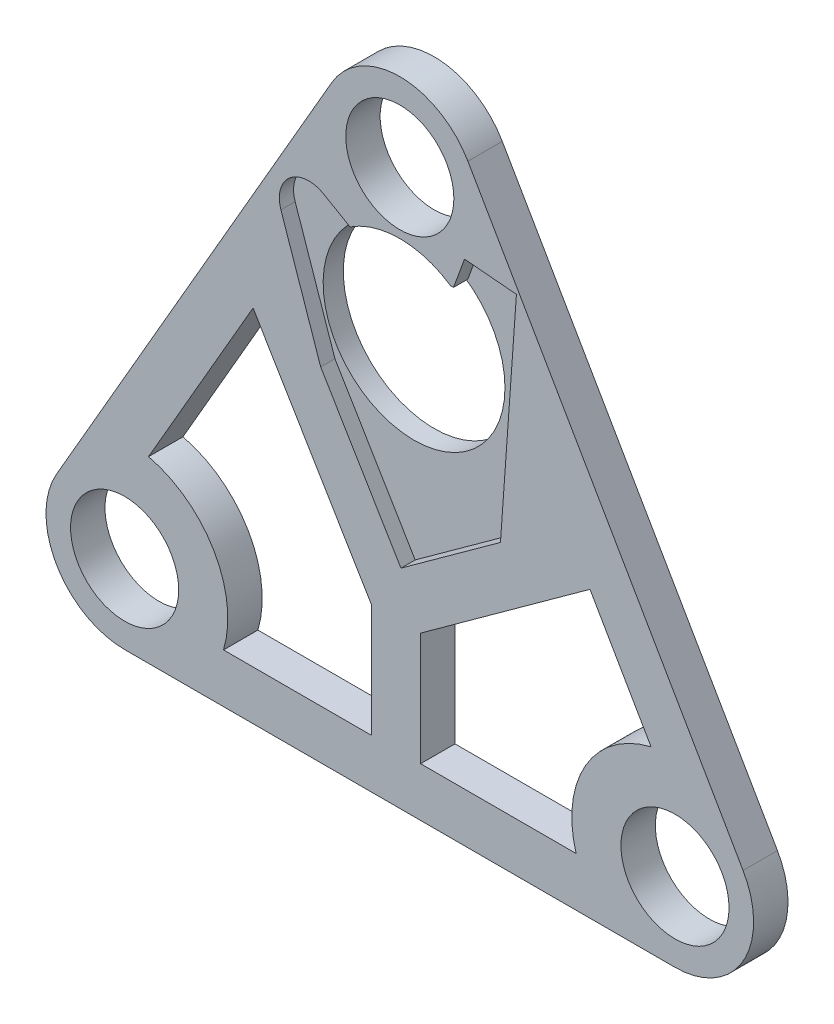
ISO-10303-21;
HEADER;
FILE_DESCRIPTION(('STEP AP214'),'2;1');
FILE_NAME('part.step','',(''),(''),'','','');
FILE_SCHEMA(('AUTOMOTIVE_DESIGN { 1 0 10303 214 1 1 1 1 }'));
ENDSEC;
DATA;
#1=APPLICATION_CONTEXT('core data for automotive mechanical design processes');
#2=APPLICATION_PROTOCOL_DEFINITION('international standard','automotive_design',2000,#1);
#3=PRODUCT_CONTEXT('',#1,'mechanical');
#4=PRODUCT('Part','Part','',(#3));
#5=PRODUCT_RELATED_PRODUCT_CATEGORY('part','',(#4));
#6=PRODUCT_DEFINITION_FORMATION('','',#4);
#7=PRODUCT_DEFINITION_CONTEXT('part definition',#1,'design');
#8=PRODUCT_DEFINITION('design','',#6,#7);
#9=PRODUCT_DEFINITION_SHAPE('','',#8);
#10=(LENGTH_UNIT() NAMED_UNIT(*) SI_UNIT(.MILLI.,.METRE.));
#11=(NAMED_UNIT(*) PLANE_ANGLE_UNIT() SI_UNIT($,.RADIAN.));
#12=(NAMED_UNIT(*) SI_UNIT($,.STERADIAN.) SOLID_ANGLE_UNIT());
#13=UNCERTAINTY_MEASURE_WITH_UNIT(LENGTH_MEASURE(1.E-05),#10,'distance_accuracy_value','');
#14=(GEOMETRIC_REPRESENTATION_CONTEXT(3) GLOBAL_UNCERTAINTY_ASSIGNED_CONTEXT((#13)) GLOBAL_UNIT_ASSIGNED_CONTEXT((#10,
#11,#12)) REPRESENTATION_CONTEXT('',''));
#15=CARTESIAN_POINT('',(0.,0.,0.));
#16=DIRECTION('',(0.,0.,1.));
#17=DIRECTION('',(1.,0.,0.));
#18=AXIS2_PLACEMENT_3D('',#15,#16,#17);
#19=CARTESIAN_POINT('',(56.,96.9948452238571,7.));
#20=DIRECTION('',(0.,0.,1.));
#21=DIRECTION('',(1.,0.,0.));
#22=AXIS2_PLACEMENT_3D('',#19,#20,#21);
#23=PLANE('',#22);
#24=DIRECTION('',(-0.51350839061396,0.858084572037664,0.));
#25=VECTOR('',#24,1.);
#26=CARTESIAN_POINT('',(26.1396160586901,57.2751431039945,7.));
#27=LINE('',#26,#25);
#28=CARTESIAN_POINT('',(50.2315466242087,17.0169617251912,7.));
#29=VERTEX_POINT('',#28);
#30=CARTESIAN_POINT('',(26.1396160586901,57.2751431039945,7.));
#31=VERTEX_POINT('',#30);
#32=EDGE_CURVE('E57',#29,#31,#27,.T.);
#33=ORIENTED_EDGE('',*,*,#32,.F.);
#34=DIRECTION('',(0.,1.,0.));
#35=VECTOR('',#34,1.);
#36=CARTESIAN_POINT('',(50.2315466242087,17.0169617251912,7.));
#37=LINE('',#36,#35);
#38=CARTESIAN_POINT('',(50.2315466242087,-6.,7.));
#39=VERTEX_POINT('',#38);
#40=EDGE_CURVE('E240',#39,#29,#37,.T.);
#41=ORIENTED_EDGE('',*,*,#40,.F.);
#42=DIRECTION('',(1.,0.,0.));
#43=VECTOR('',#42,1.);
#44=CARTESIAN_POINT('',(20.1246117974981,-6.,7.));
#45=LINE('',#44,#43);
#46=CARTESIAN_POINT('',(20.1246117974981,-6.00000000000001,7.));
#47=VERTEX_POINT('',#46);
#48=EDGE_CURVE('E244',#47,#39,#45,.T.);
#49=ORIENTED_EDGE('',*,*,#48,.F.);
#50=CARTESIAN_POINT('',(0.,0.,7.));
#51=DIRECTION('',(0.,0.,-1.));
#52=DIRECTION('',(1.,0.,0.));
#53=AXIS2_PLACEMENT_3D('',#50,#51,#52);
#54=CIRCLE('',#53,21.);
#55=CARTESIAN_POINT('',(4.86615347604242,20.4284250579334,7.));
#56=VERTEX_POINT('',#55);
#57=EDGE_CURVE('E260',#56,#47,#54,.T.);
#58=ORIENTED_EDGE('',*,*,#57,.F.);
#59=DIRECTION('',(-0.5,-0.866025403784439,0.));
#60=VECTOR('',#59,1.);
#61=CARTESIAN_POINT('',(26.1396160586901,57.2751431039945,7.));
#62=LINE('',#61,#60);
#63=EDGE_CURVE('E256',#31,#56,#62,.T.);
#64=ORIENTED_EDGE('',*,*,#63,.F.);
#65=EDGE_LOOP('',(#33,#41,#49,#58,#64));
#66=FACE_BOUND('',#65,.T.);
#67=CARTESIAN_POINT('',(112.,0.,7.));
#68=DIRECTION('',(0.,0.,-1.));
#69=DIRECTION('',(1.,0.,0.));
#70=AXIS2_PLACEMENT_3D('',#67,#68,#69);
#71=CIRCLE('',#70,21.);
#72=CARTESIAN_POINT('',(91.8753882025019,-6.,7.));
#73=VERTEX_POINT('',#72);
#74=CARTESIAN_POINT('',(107.133846523958,20.4284250579333,7.));
#75=VERTEX_POINT('',#74);
#76=EDGE_CURVE('E65',#73,#75,#71,.T.);
#77=ORIENTED_EDGE('',*,*,#76,.F.);
#78=DIRECTION('',(1.,0.,0.));
#79=VECTOR('',#78,1.);
#80=CARTESIAN_POINT('',(60.2315466242087,-6.,7.));
#81=LINE('',#80,#79);
#82=CARTESIAN_POINT('',(60.2315466242087,-6.,7.));
#83=VERTEX_POINT('',#82);
#84=EDGE_CURVE('E284',#83,#73,#81,.T.);
#85=ORIENTED_EDGE('',*,*,#84,.F.);
#86=DIRECTION('',(0.,-1.,0.));
#87=VECTOR('',#86,1.);
#88=CARTESIAN_POINT('',(60.2315466242087,17.0169617251913,7.));
#89=LINE('',#88,#87);
#90=CARTESIAN_POINT('',(60.2315466242087,17.0169617251913,7.));
#91=VERTEX_POINT('',#90);
#92=EDGE_CURVE('E311',#91,#83,#89,.T.);
#93=ORIENTED_EDGE('',*,*,#92,.F.);
#94=DIRECTION('',(-0.810064095987129,-0.586341334371504,0.));
#95=VECTOR('',#94,1.);
#96=CARTESIAN_POINT('',(94.6994013606131,41.965515844775,7.));
#97=LINE('',#96,#95);
#98=CARTESIAN_POINT('',(94.6994013606131,41.965515844775,7.));
#99=VERTEX_POINT('',#98);
#100=EDGE_CURVE('E307',#99,#91,#97,.T.);
#101=ORIENTED_EDGE('',*,*,#100,.F.);
#102=DIRECTION('',(-0.5,0.866025403784439,0.));
#103=VECTOR('',#102,1.);
#104=CARTESIAN_POINT('',(94.6994013606131,41.965515844775,7.));
#105=LINE('',#104,#103);
#106=EDGE_CURVE('E303',#75,#99,#105,.T.);
#107=ORIENTED_EDGE('',*,*,#106,.F.);
#108=EDGE_LOOP('',(#77,#85,#93,#101,#107));
#109=FACE_BOUND('',#108,.T.);
#110=DIRECTION('',(-0.866025403784443,0.499999999999992,0.));
#111=VECTOR('',#110,1.);
#112=CARTESIAN_POINT('',(46.11,81.2948452238571,7.));
#113=LINE('',#112,#111);
#114=CARTESIAN_POINT('',(45.8768837947941,81.4294349276852,7.));
#115=VERTEX_POINT('',#114);
#116=CARTESIAN_POINT('',(40.4808348754011,84.5448452238571,7.));
#117=VERTEX_POINT('',#116);
#118=EDGE_CURVE('E270',#115,#117,#113,.T.);
#119=ORIENTED_EDGE('',*,*,#118,.F.);
#120=CARTESIAN_POINT('',(56.,65.9448452238571,7.));
#121=DIRECTION('',(0.,0.,1.));
#122=DIRECTION('',(1.,0.,0.));
#123=AXIS2_PLACEMENT_3D('',#120,#121,#122);
#124=CIRCLE('',#123,18.5);
#125=CARTESIAN_POINT('',(66.3260592676974,81.2948452238571,7.));
#126=VERTEX_POINT('',#125);
#127=EDGE_CURVE('E402',#126,#115,#124,.T.);
#128=ORIENTED_EDGE('',*,*,#127,.F.);
#129=DIRECTION('',(-1.,0.,0.));
#130=VECTOR('',#129,1.);
#131=CARTESIAN_POINT('',(46.11,81.2948452238571,7.));
#132=LINE('',#131,#130);
#133=CARTESIAN_POINT('',(66.94,81.2948452238571,7.));
#134=VERTEX_POINT('',#133);
#135=EDGE_CURVE('E335',#134,#126,#132,.T.);
#136=ORIENTED_EDGE('',*,*,#135,.F.);
#137=DIRECTION('',(-0.342020143325666,-0.939692620785909,0.));
#138=VECTOR('',#137,1.);
#139=CARTESIAN_POINT('',(66.94,81.2948452238571,7.));
#140=LINE('',#139,#138);
#141=CARTESIAN_POINT('',(69.1631309316168,87.4028472589656,7.));
#142=VERTEX_POINT('',#141);
#143=EDGE_CURVE('E393',#142,#134,#140,.T.);
#144=ORIENTED_EDGE('',*,*,#143,.F.);
#145=DIRECTION('',(-0.996194698091746,0.087155742747658,0.));
#146=VECTOR('',#145,1.);
#147=CARTESIAN_POINT('',(69.1631309316168,87.4028472589656,7.));
#148=LINE('',#147,#146);
#149=CARTESIAN_POINT('',(79.7351728545121,86.4779134403914,7.));
#150=VERTEX_POINT('',#149);
#151=EDGE_CURVE('E389',#150,#142,#148,.T.);
#152=ORIENTED_EDGE('',*,*,#151,.F.);
#153=DIRECTION('',(0.0715356429861935,0.997438044082213,0.));
#154=VECTOR('',#153,1.);
#155=CARTESIAN_POINT('',(79.7351728545121,86.4779134403914,7.));
#156=LINE('',#155,#154);
#157=CARTESIAN_POINT('',(76.4824471679298,41.1244055759732,7.));
#158=VERTEX_POINT('',#157);
#159=EDGE_CURVE('E385',#158,#150,#156,.T.);
#160=ORIENTED_EDGE('',*,*,#159,.F.);
#161=DIRECTION('',(0.810064095987129,0.586341334371504,0.));
#162=VECTOR('',#161,1.);
#163=CARTESIAN_POINT('',(76.4824471679298,41.1244055759732,7.));
#164=LINE('',#163,#162);
#165=CARTESIAN_POINT('',(56.2308447682516,26.4658722166855,7.));
#166=VERTEX_POINT('',#165);
#167=EDGE_CURVE('E381',#166,#158,#164,.T.);
#168=ORIENTED_EDGE('',*,*,#167,.F.);
#169=DIRECTION('',(0.51350839061396,-0.858084572037664,0.));
#170=VECTOR('',#169,1.);
#171=CARTESIAN_POINT('',(56.2308447682516,26.4658722166855,7.));
#172=LINE('',#171,#170);
#173=CARTESIAN_POINT('',(39.9012779467277,53.7529616074832,7.));
#174=VERTEX_POINT('',#173);
#175=EDGE_CURVE('E377',#174,#166,#172,.T.);
#176=ORIENTED_EDGE('',*,*,#175,.F.);
#177=DIRECTION('',(0.323881185998739,-0.94609776310699,0.));
#178=VECTOR('',#177,1.);
#179=CARTESIAN_POINT('',(39.9012779467277,53.7529616074832,7.));
#180=LINE('',#179,#178);
#181=CARTESIAN_POINT('',(31.8042482967592,77.405405685158,7.));
#182=VERTEX_POINT('',#181);
#183=EDGE_CURVE('E373',#182,#174,#180,.T.);
#184=ORIENTED_EDGE('',*,*,#183,.F.);
#185=CARTESIAN_POINT('',(37.4808348754012,79.3486928011504,7.));
#186=DIRECTION('',(0.,0.,1.));
#187=DIRECTION('',(1.,0.,0.));
#188=AXIS2_PLACEMENT_3D('',#185,#186,#187);
#189=CIRCLE('',#188,5.99999999999999);
#190=EDGE_CURVE('E369',#117,#182,#189,.T.);
#191=ORIENTED_EDGE('',*,*,#190,.F.);
#192=EDGE_LOOP('',(#119,#128,#136,#144,#152,#160,#168,#176,#184,#191));
#193=FACE_BOUND('',#192,.T.);
#194=CARTESIAN_POINT('',(112.,0.,7.));
#195=DIRECTION('',(0.,0.,1.));
#196=DIRECTION('',(1.,0.,0.));
#197=AXIS2_PLACEMENT_3D('',#194,#195,#196);
#198=CIRCLE('',#197,11.);
#199=CARTESIAN_POINT('',(123.,0.,7.));
#200=VERTEX_POINT('',#199);
#201=EDGE_CURVE('E440',#200,#200,#198,.T.);
#202=ORIENTED_EDGE('',*,*,#201,.F.);
#203=EDGE_LOOP('',(#202));
#204=FACE_BOUND('',#203,.T.);
#205=CARTESIAN_POINT('',(56.,96.9948452238571,7.));
#206=DIRECTION('',(0.,0.,1.));
#207=DIRECTION('',(1.,0.,0.));
#208=AXIS2_PLACEMENT_3D('',#205,#206,#207);
#209=CIRCLE('',#208,16.);
#210=CARTESIAN_POINT('',(69.856406460551,104.994845223857,7.));
#211=VERTEX_POINT('',#210);
#212=CARTESIAN_POINT('',(42.143593539449,104.994845223857,7.));
#213=VERTEX_POINT('',#212);
#214=EDGE_CURVE('E456',#211,#213,#209,.T.);
#215=ORIENTED_EDGE('',*,*,#214,.T.);
#216=DIRECTION('',(-0.5,-0.866025403784439,0.));
#217=VECTOR('',#216,1.);
#218=CARTESIAN_POINT('',(42.143593539449,104.994845223857,7.));
#219=LINE('',#218,#217);
#220=CARTESIAN_POINT('',(-13.856406460551,8.,7.));
#221=VERTEX_POINT('',#220);
#222=EDGE_CURVE('E460',#213,#221,#219,.T.);
#223=ORIENTED_EDGE('',*,*,#222,.T.);
#224=CARTESIAN_POINT('',(0.,0.,7.));
#225=DIRECTION('',(0.,0.,1.));
#226=DIRECTION('',(1.,0.,0.));
#227=AXIS2_PLACEMENT_3D('',#224,#225,#226);
#228=CIRCLE('',#227,16.);
#229=CARTESIAN_POINT('',(0.,-16.,7.));
#230=VERTEX_POINT('',#229);
#231=EDGE_CURVE('E464',#221,#230,#228,.T.);
#232=ORIENTED_EDGE('',*,*,#231,.T.);
#233=DIRECTION('',(1.,0.,0.));
#234=VECTOR('',#233,1.);
#235=CARTESIAN_POINT('',(0.,-16.,7.));
#236=LINE('',#235,#234);
#237=CARTESIAN_POINT('',(112.,-16.,7.));
#238=VERTEX_POINT('',#237);
#239=EDGE_CURVE('E467',#230,#238,#236,.T.);
#240=ORIENTED_EDGE('',*,*,#239,.T.);
#241=CARTESIAN_POINT('',(112.,0.,7.));
#242=DIRECTION('',(0.,0.,1.));
#243=DIRECTION('',(1.,0.,0.));
#244=AXIS2_PLACEMENT_3D('',#241,#242,#243);
#245=CIRCLE('',#244,16.);
#246=CARTESIAN_POINT('',(125.856406460551,8.,7.));
#247=VERTEX_POINT('',#246);
#248=EDGE_CURVE('E470',#238,#247,#245,.T.);
#249=ORIENTED_EDGE('',*,*,#248,.T.);
#250=DIRECTION('',(-0.5,0.866025403784438,0.));
#251=VECTOR('',#250,1.);
#252=CARTESIAN_POINT('',(69.856406460551,104.994845223857,7.));
#253=LINE('',#252,#251);
#254=EDGE_CURVE('E473',#247,#211,#253,.T.);
#255=ORIENTED_EDGE('',*,*,#254,.T.);
#256=EDGE_LOOP('',(#215,#223,#232,#240,#249,#255));
#257=FACE_BOUND('',#256,.T.);
#258=CARTESIAN_POINT('',(0.,0.,7.));
#259=DIRECTION('',(0.,0.,1.));
#260=DIRECTION('',(1.,0.,0.));
#261=AXIS2_PLACEMENT_3D('',#258,#259,#260);
#262=CIRCLE('',#261,11.);
#263=CARTESIAN_POINT('',(11.,0.,7.));
#264=VERTEX_POINT('',#263);
#265=EDGE_CURVE('E448',#264,#264,#262,.T.);
#266=ORIENTED_EDGE('',*,*,#265,.F.);
#267=EDGE_LOOP('',(#266));
#268=FACE_BOUND('',#267,.T.);
#269=CARTESIAN_POINT('',(56.,96.9948452238571,7.));
#270=DIRECTION('',(0.,0.,1.));
#271=DIRECTION('',(1.,0.,0.));
#272=AXIS2_PLACEMENT_3D('',#269,#270,#271);
#273=CIRCLE('',#272,11.);
#274=CARTESIAN_POINT('',(67.,96.9948452238571,7.));
#275=VERTEX_POINT('',#274);
#276=EDGE_CURVE('E432',#275,#275,#273,.T.);
#277=ORIENTED_EDGE('',*,*,#276,.F.);
#278=EDGE_LOOP('',(#277));
#279=FACE_BOUND('',#278,.T.);
#280=ADVANCED_FACE('F41',(#66,#109,#193,#204,#257,#268,#279),#23,.T.);
#281=CARTESIAN_POINT('',(56.,96.9948452238571,0.));
#282=DIRECTION('',(0.,0.,1.));
#283=DIRECTION('',(1.,0.,0.));
#284=AXIS2_PLACEMENT_3D('',#281,#282,#283);
#285=PLANE('',#284);
#286=DIRECTION('',(0.,1.,0.));
#287=VECTOR('',#286,1.);
#288=CARTESIAN_POINT('',(50.2315466242087,17.0169617251912,0.));
#289=LINE('',#288,#287);
#290=CARTESIAN_POINT('',(50.2315466242087,-6.,0.));
#291=VERTEX_POINT('',#290);
#292=CARTESIAN_POINT('',(50.2315466242087,17.0169617251912,0.));
#293=VERTEX_POINT('',#292);
#294=EDGE_CURVE('E224',#291,#293,#289,.T.);
#295=ORIENTED_EDGE('',*,*,#294,.T.);
#296=DIRECTION('',(-0.51350839061396,0.858084572037664,0.));
#297=VECTOR('',#296,1.);
#298=CARTESIAN_POINT('',(26.1396160586901,57.2751431039945,0.));
#299=LINE('',#298,#297);
#300=CARTESIAN_POINT('',(26.1396160586901,57.2751431039945,0.));
#301=VERTEX_POINT('',#300);
#302=EDGE_CURVE('E217',#293,#301,#299,.T.);
#303=ORIENTED_EDGE('',*,*,#302,.T.);
#304=DIRECTION('',(-0.5,-0.866025403784439,0.));
#305=VECTOR('',#304,1.);
#306=CARTESIAN_POINT('',(26.1396160586901,57.2751431039945,0.));
#307=LINE('',#306,#305);
#308=CARTESIAN_POINT('',(4.86615347604242,20.4284250579334,0.));
#309=VERTEX_POINT('',#308);
#310=EDGE_CURVE('E228',#301,#309,#307,.T.);
#311=ORIENTED_EDGE('',*,*,#310,.T.);
#312=CARTESIAN_POINT('',(0.,0.,0.));
#313=DIRECTION('',(0.,0.,-1.));
#314=DIRECTION('',(1.,0.,0.));
#315=AXIS2_PLACEMENT_3D('',#312,#313,#314);
#316=CIRCLE('',#315,21.);
#317=CARTESIAN_POINT('',(20.1246117974981,-6.00000000000001,0.));
#318=VERTEX_POINT('',#317);
#319=EDGE_CURVE('E233',#309,#318,#316,.T.);
#320=ORIENTED_EDGE('',*,*,#319,.T.);
#321=DIRECTION('',(1.,0.,0.));
#322=VECTOR('',#321,1.);
#323=CARTESIAN_POINT('',(20.1246117974981,-6.,0.));
#324=LINE('',#323,#322);
#325=EDGE_CURVE('E249',#318,#291,#324,.T.);
#326=ORIENTED_EDGE('',*,*,#325,.T.);
#327=EDGE_LOOP('',(#295,#303,#311,#320,#326));
#328=FACE_BOUND('',#327,.T.);
#329=DIRECTION('',(1.,0.,0.));
#330=VECTOR('',#329,1.);
#331=CARTESIAN_POINT('',(60.2315466242087,-6.,0.));
#332=LINE('',#331,#330);
#333=CARTESIAN_POINT('',(60.2315466242087,-6.,0.));
#334=VERTEX_POINT('',#333);
#335=CARTESIAN_POINT('',(91.8753882025019,-6.,0.));
#336=VERTEX_POINT('',#335);
#337=EDGE_CURVE('E296',#334,#336,#332,.T.);
#338=ORIENTED_EDGE('',*,*,#337,.T.);
#339=CARTESIAN_POINT('',(112.,0.,0.));
#340=DIRECTION('',(0.,0.,-1.));
#341=DIRECTION('',(1.,0.,0.));
#342=AXIS2_PLACEMENT_3D('',#339,#340,#341);
#343=CIRCLE('',#342,21.);
#344=CARTESIAN_POINT('',(107.133846523958,20.4284250579333,0.));
#345=VERTEX_POINT('',#344);
#346=EDGE_CURVE('E279',#336,#345,#343,.T.);
#347=ORIENTED_EDGE('',*,*,#346,.T.);
#348=DIRECTION('',(-0.5,0.866025403784439,0.));
#349=VECTOR('',#348,1.);
#350=CARTESIAN_POINT('',(94.6994013606131,41.965515844775,0.));
#351=LINE('',#350,#349);
#352=CARTESIAN_POINT('',(94.6994013606131,41.965515844775,0.));
#353=VERTEX_POINT('',#352);
#354=EDGE_CURVE('E283',#345,#353,#351,.T.);
#355=ORIENTED_EDGE('',*,*,#354,.T.);
#356=DIRECTION('',(-0.810064095987129,-0.586341334371504,0.));
#357=VECTOR('',#356,1.);
#358=CARTESIAN_POINT('',(94.6994013606131,41.965515844775,0.));
#359=LINE('',#358,#357);
#360=CARTESIAN_POINT('',(60.2315466242087,17.0169617251913,0.));
#361=VERTEX_POINT('',#360);
#362=EDGE_CURVE('E288',#353,#361,#359,.T.);
#363=ORIENTED_EDGE('',*,*,#362,.T.);
#364=DIRECTION('',(0.,-1.,0.));
#365=VECTOR('',#364,1.);
#366=CARTESIAN_POINT('',(60.2315466242087,17.0169617251913,0.));
#367=LINE('',#366,#365);
#368=EDGE_CURVE('E292',#361,#334,#367,.T.);
#369=ORIENTED_EDGE('',*,*,#368,.T.);
#370=EDGE_LOOP('',(#338,#347,#355,#363,#369));
#371=FACE_BOUND('',#370,.T.);
#372=CARTESIAN_POINT('',(56.,65.9448452238571,0.));
#373=DIRECTION('',(0.,0.,1.));
#374=DIRECTION('',(1.,0.,0.));
#375=AXIS2_PLACEMENT_3D('',#372,#373,#374);
#376=CIRCLE('',#375,18.5);
#377=CARTESIAN_POINT('',(74.5,65.9448452238571,0.));
#378=VERTEX_POINT('',#377);
#379=EDGE_CURVE('E424',#378,#378,#376,.T.);
#380=ORIENTED_EDGE('',*,*,#379,.T.);
#381=EDGE_LOOP('',(#380));
#382=FACE_BOUND('',#381,.T.);
#383=CARTESIAN_POINT('',(56.,96.9948452238571,0.));
#384=DIRECTION('',(0.,0.,1.));
#385=DIRECTION('',(1.,0.,0.));
#386=AXIS2_PLACEMENT_3D('',#383,#384,#385);
#387=CIRCLE('',#386,16.);
#388=CARTESIAN_POINT('',(69.856406460551,104.994845223857,0.));
#389=VERTEX_POINT('',#388);
#390=CARTESIAN_POINT('',(42.143593539449,104.994845223857,0.));
#391=VERTEX_POINT('',#390);
#392=EDGE_CURVE('E452',#389,#391,#387,.T.);
#393=ORIENTED_EDGE('',*,*,#392,.F.);
#394=DIRECTION('',(-0.5,0.866025403784438,0.));
#395=VECTOR('',#394,1.);
#396=CARTESIAN_POINT('',(69.856406460551,104.994845223857,0.));
#397=LINE('',#396,#395);
#398=CARTESIAN_POINT('',(125.856406460551,8.,0.));
#399=VERTEX_POINT('',#398);
#400=EDGE_CURVE('E461',#399,#389,#397,.T.);
#401=ORIENTED_EDGE('',*,*,#400,.F.);
#402=CARTESIAN_POINT('',(112.,0.,0.));
#403=DIRECTION('',(0.,0.,1.));
#404=DIRECTION('',(1.,0.,0.));
#405=AXIS2_PLACEMENT_3D('',#402,#403,#404);
#406=CIRCLE('',#405,16.);
#407=CARTESIAN_POINT('',(112.,-16.,0.));
#408=VERTEX_POINT('',#407);
#409=EDGE_CURVE('E489',#408,#399,#406,.T.);
#410=ORIENTED_EDGE('',*,*,#409,.F.);
#411=DIRECTION('',(1.,0.,0.));
#412=VECTOR('',#411,1.);
#413=CARTESIAN_POINT('',(0.,-16.,0.));
#414=LINE('',#413,#412);
#415=CARTESIAN_POINT('',(0.,-16.,0.));
#416=VERTEX_POINT('',#415);
#417=EDGE_CURVE('E486',#416,#408,#414,.T.);
#418=ORIENTED_EDGE('',*,*,#417,.F.);
#419=CARTESIAN_POINT('',(0.,0.,0.));
#420=DIRECTION('',(0.,0.,1.));
#421=DIRECTION('',(1.,0.,0.));
#422=AXIS2_PLACEMENT_3D('',#419,#420,#421);
#423=CIRCLE('',#422,16.);
#424=CARTESIAN_POINT('',(-13.856406460551,8.,0.));
#425=VERTEX_POINT('',#424);
#426=EDGE_CURVE('E483',#425,#416,#423,.T.);
#427=ORIENTED_EDGE('',*,*,#426,.F.);
#428=DIRECTION('',(-0.5,-0.866025403784439,0.));
#429=VECTOR('',#428,1.);
#430=CARTESIAN_POINT('',(42.143593539449,104.994845223857,0.));
#431=LINE('',#430,#429);
#432=EDGE_CURVE('E480',#391,#425,#431,.T.);
#433=ORIENTED_EDGE('',*,*,#432,.F.);
#434=EDGE_LOOP('',(#393,#401,#410,#418,#427,#433));
#435=FACE_BOUND('',#434,.T.);
#436=CARTESIAN_POINT('',(0.,0.,0.));
#437=DIRECTION('',(0.,0.,1.));
#438=DIRECTION('',(1.,0.,0.));
#439=AXIS2_PLACEMENT_3D('',#436,#437,#438);
#440=CIRCLE('',#439,11.);
#441=CARTESIAN_POINT('',(11.,0.,0.));
#442=VERTEX_POINT('',#441);
#443=EDGE_CURVE('E444',#442,#442,#440,.T.);
#444=ORIENTED_EDGE('',*,*,#443,.T.);
#445=EDGE_LOOP('',(#444));
#446=FACE_BOUND('',#445,.T.);
#447=CARTESIAN_POINT('',(112.,0.,0.));
#448=DIRECTION('',(0.,0.,1.));
#449=DIRECTION('',(1.,0.,0.));
#450=AXIS2_PLACEMENT_3D('',#447,#448,#449);
#451=CIRCLE('',#450,11.);
#452=CARTESIAN_POINT('',(123.,0.,0.));
#453=VERTEX_POINT('',#452);
#454=EDGE_CURVE('E436',#453,#453,#451,.T.);
#455=ORIENTED_EDGE('',*,*,#454,.T.);
#456=EDGE_LOOP('',(#455));
#457=FACE_BOUND('',#456,.T.);
#458=CARTESIAN_POINT('',(56.,96.9948452238571,0.));
#459=DIRECTION('',(0.,0.,1.));
#460=DIRECTION('',(1.,0.,0.));
#461=AXIS2_PLACEMENT_3D('',#458,#459,#460);
#462=CIRCLE('',#461,11.);
#463=CARTESIAN_POINT('',(67.,96.9948452238571,0.));
#464=VERTEX_POINT('',#463);
#465=EDGE_CURVE('E428',#464,#464,#462,.T.);
#466=ORIENTED_EDGE('',*,*,#465,.T.);
#467=EDGE_LOOP('',(#466));
#468=FACE_BOUND('',#467,.T.);
#469=ADVANCED_FACE('F235',(#328,#371,#382,#435,#446,#457,#468),#285,.F.);
#470=CARTESIAN_POINT('',(56.,96.9948452238571,7.));
#471=DIRECTION('',(0.,0.,-1.));
#472=DIRECTION('',(-1.,0.,0.));
#473=AXIS2_PLACEMENT_3D('',#470,#471,#472);
#474=CYLINDRICAL_SURFACE('',#473,16.);
#475=ORIENTED_EDGE('',*,*,#392,.T.);
#476=DIRECTION('',(0.,0.,-1.));
#477=VECTOR('',#476,1.);
#478=CARTESIAN_POINT('',(42.143593539449,104.994845223857,7.));
#479=LINE('',#478,#477);
#480=EDGE_CURVE('E513',#213,#391,#479,.T.);
#481=ORIENTED_EDGE('',*,*,#480,.F.);
#482=ORIENTED_EDGE('',*,*,#214,.F.);
#483=DIRECTION('',(0.,0.,-1.));
#484=VECTOR('',#483,1.);
#485=CARTESIAN_POINT('',(69.856406460551,104.994845223857,7.));
#486=LINE('',#485,#484);
#487=EDGE_CURVE('E476',#211,#389,#486,.T.);
#488=ORIENTED_EDGE('',*,*,#487,.T.);
#489=EDGE_LOOP('',(#475,#481,#482,#488));
#490=FACE_BOUND('',#489,.T.);
#491=ADVANCED_FACE('F43',(#490),#474,.T.);
#492=CARTESIAN_POINT('',(42.143593539449,104.994845223857,7.));
#493=DIRECTION('',(0.866025403784439,-0.5,0.));
#494=DIRECTION('',(0.5,0.866025403784439,0.));
#495=AXIS2_PLACEMENT_3D('',#492,#493,#494);
#496=PLANE('',#495);
#497=ORIENTED_EDGE('',*,*,#432,.T.);
#498=DIRECTION('',(0.,0.,-1.));
#499=VECTOR('',#498,1.);
#500=CARTESIAN_POINT('',(-13.856406460551,8.,7.));
#501=LINE('',#500,#499);
#502=EDGE_CURVE('E509',#221,#425,#501,.T.);
#503=ORIENTED_EDGE('',*,*,#502,.F.);
#504=ORIENTED_EDGE('',*,*,#222,.F.);
#505=ORIENTED_EDGE('',*,*,#480,.T.);
#506=EDGE_LOOP('',(#497,#503,#504,#505));
#507=FACE_BOUND('',#506,.T.);
#508=ADVANCED_FACE('F603',(#507),#496,.F.);
#509=CARTESIAN_POINT('',(0.,0.,7.));
#510=DIRECTION('',(0.,0.,-1.));
#511=DIRECTION('',(-1.,0.,0.));
#512=AXIS2_PLACEMENT_3D('',#509,#510,#511);
#513=CYLINDRICAL_SURFACE('',#512,16.);
#514=ORIENTED_EDGE('',*,*,#426,.T.);
#515=DIRECTION('',(0.,0.,-1.));
#516=VECTOR('',#515,1.);
#517=CARTESIAN_POINT('',(0.,-16.,7.));
#518=LINE('',#517,#516);
#519=EDGE_CURVE('E505',#230,#416,#518,.T.);
#520=ORIENTED_EDGE('',*,*,#519,.F.);
#521=ORIENTED_EDGE('',*,*,#231,.F.);
#522=ORIENTED_EDGE('',*,*,#502,.T.);
#523=EDGE_LOOP('',(#514,#520,#521,#522));
#524=FACE_BOUND('',#523,.T.);
#525=ADVANCED_FACE('F600',(#524),#513,.T.);
#526=CARTESIAN_POINT('',(0.,-16.,7.));
#527=DIRECTION('',(0.,1.,0.));
#528=DIRECTION('',(0.,0.,1.));
#529=AXIS2_PLACEMENT_3D('',#526,#527,#528);
#530=PLANE('',#529);
#531=ORIENTED_EDGE('',*,*,#417,.T.);
#532=DIRECTION('',(0.,0.,-1.));
#533=VECTOR('',#532,1.);
#534=CARTESIAN_POINT('',(112.,-16.,7.));
#535=LINE('',#534,#533);
#536=EDGE_CURVE('E501',#238,#408,#535,.T.);
#537=ORIENTED_EDGE('',*,*,#536,.F.);
#538=ORIENTED_EDGE('',*,*,#239,.F.);
#539=ORIENTED_EDGE('',*,*,#519,.T.);
#540=EDGE_LOOP('',(#531,#537,#538,#539));
#541=FACE_BOUND('',#540,.T.);
#542=ADVANCED_FACE('F596',(#541),#530,.F.);
#543=CARTESIAN_POINT('',(112.,0.,7.));
#544=DIRECTION('',(0.,0.,-1.));
#545=DIRECTION('',(-1.,0.,0.));
#546=AXIS2_PLACEMENT_3D('',#543,#544,#545);
#547=CYLINDRICAL_SURFACE('',#546,16.);
#548=ORIENTED_EDGE('',*,*,#409,.T.);
#549=DIRECTION('',(0.,0.,-1.));
#550=VECTOR('',#549,1.);
#551=CARTESIAN_POINT('',(125.856406460551,8.,7.));
#552=LINE('',#551,#550);
#553=EDGE_CURVE('E497',#247,#399,#552,.T.);
#554=ORIENTED_EDGE('',*,*,#553,.F.);
#555=ORIENTED_EDGE('',*,*,#248,.F.);
#556=ORIENTED_EDGE('',*,*,#536,.T.);
#557=EDGE_LOOP('',(#548,#554,#555,#556));
#558=FACE_BOUND('',#557,.T.);
#559=ADVANCED_FACE('F592',(#558),#547,.T.);
#560=CARTESIAN_POINT('',(69.856406460551,104.994845223857,7.));
#561=DIRECTION('',(-0.866025403784438,-0.5,0.));
#562=DIRECTION('',(0.5,-0.866025403784439,0.));
#563=AXIS2_PLACEMENT_3D('',#560,#561,#562);
#564=PLANE('',#563);
#565=ORIENTED_EDGE('',*,*,#400,.T.);
#566=ORIENTED_EDGE('',*,*,#487,.F.);
#567=ORIENTED_EDGE('',*,*,#254,.F.);
#568=ORIENTED_EDGE('',*,*,#553,.T.);
#569=EDGE_LOOP('',(#565,#566,#567,#568));
#570=FACE_BOUND('',#569,.T.);
#571=ADVANCED_FACE('F589',(#570),#564,.F.);
#572=CARTESIAN_POINT('',(0.,0.,7.));
#573=DIRECTION('',(0.,0.,-1.));
#574=DIRECTION('',(-1.,0.,0.));
#575=AXIS2_PLACEMENT_3D('',#572,#573,#574);
#576=CYLINDRICAL_SURFACE('',#575,11.);
#577=ORIENTED_EDGE('',*,*,#265,.T.);
#578=EDGE_LOOP('',(#577));
#579=FACE_BOUND('',#578,.T.);
#580=ORIENTED_EDGE('',*,*,#443,.F.);
#581=EDGE_LOOP('',(#580));
#582=FACE_BOUND('',#581,.T.);
#583=ADVANCED_FACE('F586',(#579,#582),#576,.F.);
#584=CARTESIAN_POINT('',(112.,0.,7.));
#585=DIRECTION('',(0.,0.,-1.));
#586=DIRECTION('',(-1.,0.,0.));
#587=AXIS2_PLACEMENT_3D('',#584,#585,#586);
#588=CYLINDRICAL_SURFACE('',#587,11.);
#589=ORIENTED_EDGE('',*,*,#201,.T.);
#590=EDGE_LOOP('',(#589));
#591=FACE_BOUND('',#590,.T.);
#592=ORIENTED_EDGE('',*,*,#454,.F.);
#593=EDGE_LOOP('',(#592));
#594=FACE_BOUND('',#593,.T.);
#595=ADVANCED_FACE('F638',(#591,#594),#588,.F.);
#596=CARTESIAN_POINT('',(56.,96.9948452238571,7.));
#597=DIRECTION('',(0.,0.,-1.));
#598=DIRECTION('',(-1.,0.,0.));
#599=AXIS2_PLACEMENT_3D('',#596,#597,#598);
#600=CYLINDRICAL_SURFACE('',#599,11.);
#601=ORIENTED_EDGE('',*,*,#276,.T.);
#602=EDGE_LOOP('',(#601));
#603=FACE_BOUND('',#602,.T.);
#604=ORIENTED_EDGE('',*,*,#465,.F.);
#605=EDGE_LOOP('',(#604));
#606=FACE_BOUND('',#605,.T.);
#607=ADVANCED_FACE('F635',(#603,#606),#600,.F.);
#608=CARTESIAN_POINT('',(56.,65.9448452238571,0.));
#609=DIRECTION('',(0.,0.,1.));
#610=DIRECTION('',(1.,0.,0.));
#611=AXIS2_PLACEMENT_3D('',#608,#609,#610);
#612=CYLINDRICAL_SURFACE('',#611,18.5);
#613=ORIENTED_EDGE('',*,*,#127,.T.);
#614=DIRECTION('',(0.,0.,1.));
#615=VECTOR('',#614,1.);
#616=CARTESIAN_POINT('',(45.8768837947941,81.4294349276852,0.));
#617=LINE('',#616,#615);
#618=CARTESIAN_POINT('',(45.8768837947941,81.4294349276852,4.1));
#619=VERTEX_POINT('',#618);
#620=EDGE_CURVE('E11',#115,#619,#617,.F.);
#621=ORIENTED_EDGE('',*,*,#620,.T.);
#622=CARTESIAN_POINT('',(56.,65.9448452238571,4.1));
#623=DIRECTION('',(0.,0.,1.));
#624=DIRECTION('',(1.,0.,0.));
#625=AXIS2_PLACEMENT_3D('',#622,#623,#624);
#626=CIRCLE('',#625,18.5);
#627=CARTESIAN_POINT('',(66.3260592676974,81.2948452238571,4.1));
#628=VERTEX_POINT('',#627);
#629=EDGE_CURVE('E517',#628,#619,#626,.F.);
#630=ORIENTED_EDGE('',*,*,#629,.F.);
#631=DIRECTION('',(0.,0.,1.));
#632=VECTOR('',#631,1.);
#633=CARTESIAN_POINT('',(66.3260592676974,81.2948452238571,0.));
#634=LINE('',#633,#632);
#635=EDGE_CURVE('E50',#628,#126,#634,.T.);
#636=ORIENTED_EDGE('',*,*,#635,.T.);
#637=EDGE_LOOP('',(#613,#621,#630,#636));
#638=FACE_BOUND('',#637,.T.);
#639=ORIENTED_EDGE('',*,*,#379,.F.);
#640=EDGE_LOOP('',(#639));
#641=FACE_BOUND('',#640,.T.);
#642=ADVANCED_FACE('F525',(#638,#641),#612,.F.);
#643=CARTESIAN_POINT('',(46.11,81.2948452238571,4.1));
#644=DIRECTION('',(0.499999999999992,0.866025403784443,0.));
#645=DIRECTION('',(-0.866025403784443,0.499999999999992,0.));
#646=AXIS2_PLACEMENT_3D('',#643,#644,#645);
#647=PLANE('',#646);
#648=ORIENTED_EDGE('',*,*,#118,.T.);
#649=DIRECTION('',(0.,0.,1.));
#650=VECTOR('',#649,1.);
#651=CARTESIAN_POINT('',(40.4808348754011,84.5448452238571,4.1));
#652=LINE('',#651,#650);
#653=CARTESIAN_POINT('',(40.4808348754011,84.5448452238571,4.1));
#654=VERTEX_POINT('',#653);
#655=EDGE_CURVE('E366',#654,#117,#652,.T.);
#656=ORIENTED_EDGE('',*,*,#655,.F.);
#657=DIRECTION('',(-0.866025403784443,0.499999999999992,0.));
#658=VECTOR('',#657,1.);
#659=CARTESIAN_POINT('',(46.11,81.2948452238571,4.1));
#660=LINE('',#659,#658);
#661=EDGE_CURVE('E331',#619,#654,#660,.T.);
#662=ORIENTED_EDGE('',*,*,#661,.F.);
#663=ORIENTED_EDGE('',*,*,#620,.F.);
#664=EDGE_LOOP('',(#648,#656,#662,#663));
#665=FACE_BOUND('',#664,.T.);
#666=ADVANCED_FACE('F538',(#665),#647,.F.);
#667=CARTESIAN_POINT('',(46.11,81.2948452238571,4.1));
#668=DIRECTION('',(0.,1.,0.));
#669=DIRECTION('',(0.,0.,1.));
#670=AXIS2_PLACEMENT_3D('',#667,#668,#669);
#671=PLANE('',#670);
#672=DIRECTION('',(-1.,0.,0.));
#673=VECTOR('',#672,1.);
#674=CARTESIAN_POINT('',(46.11,81.2948452238571,4.1));
#675=LINE('',#674,#673);
#676=CARTESIAN_POINT('',(66.94,81.2948452238571,4.1));
#677=VERTEX_POINT('',#676);
#678=EDGE_CURVE('E363',#677,#628,#675,.T.);
#679=ORIENTED_EDGE('',*,*,#678,.F.);
#680=DIRECTION('',(0.,0.,1.));
#681=VECTOR('',#680,1.);
#682=CARTESIAN_POINT('',(66.94,81.2948452238571,4.1));
#683=LINE('',#682,#681);
#684=EDGE_CURVE('E399',#677,#134,#683,.T.);
#685=ORIENTED_EDGE('',*,*,#684,.T.);
#686=ORIENTED_EDGE('',*,*,#135,.T.);
#687=ORIENTED_EDGE('',*,*,#635,.F.);
#688=EDGE_LOOP('',(#679,#685,#686,#687));
#689=FACE_BOUND('',#688,.T.);
#690=ADVANCED_FACE('F547',(#689),#671,.F.);
#691=CARTESIAN_POINT('',(37.4808348754012,79.3486928011504,4.1));
#692=DIRECTION('',(0.,0.,1.));
#693=DIRECTION('',(1.,0.,0.));
#694=AXIS2_PLACEMENT_3D('',#691,#692,#693);
#695=PLANE('',#694);
#696=ORIENTED_EDGE('',*,*,#629,.T.);
#697=ORIENTED_EDGE('',*,*,#661,.T.);
#698=CARTESIAN_POINT('',(37.4808348754012,79.3486928011504,4.1));
#699=DIRECTION('',(0.,0.,1.));
#700=DIRECTION('',(1.,0.,0.));
#701=AXIS2_PLACEMENT_3D('',#698,#699,#700);
#702=CIRCLE('',#701,5.99999999999999);
#703=CARTESIAN_POINT('',(31.8042482967592,77.405405685158,4.1));
#704=VERTEX_POINT('',#703);
#705=EDGE_CURVE('E334',#654,#704,#702,.T.);
#706=ORIENTED_EDGE('',*,*,#705,.T.);
#707=DIRECTION('',(0.323881185998739,-0.94609776310699,0.));
#708=VECTOR('',#707,1.);
#709=CARTESIAN_POINT('',(39.9012779467277,53.7529616074832,4.1));
#710=LINE('',#709,#708);
#711=CARTESIAN_POINT('',(39.9012779467277,53.7529616074832,4.1));
#712=VERTEX_POINT('',#711);
#713=EDGE_CURVE('E339',#704,#712,#710,.T.);
#714=ORIENTED_EDGE('',*,*,#713,.T.);
#715=DIRECTION('',(0.51350839061396,-0.858084572037664,0.));
#716=VECTOR('',#715,1.);
#717=CARTESIAN_POINT('',(56.2308447682516,26.4658722166855,4.1));
#718=LINE('',#717,#716);
#719=CARTESIAN_POINT('',(56.2308447682516,26.4658722166855,4.1));
#720=VERTEX_POINT('',#719);
#721=EDGE_CURVE('E343',#712,#720,#718,.T.);
#722=ORIENTED_EDGE('',*,*,#721,.T.);
#723=DIRECTION('',(0.810064095987129,0.586341334371504,0.));
#724=VECTOR('',#723,1.);
#725=CARTESIAN_POINT('',(76.4824471679298,41.1244055759732,4.1));
#726=LINE('',#725,#724);
#727=CARTESIAN_POINT('',(76.4824471679298,41.1244055759732,4.1));
#728=VERTEX_POINT('',#727);
#729=EDGE_CURVE('E347',#720,#728,#726,.T.);
#730=ORIENTED_EDGE('',*,*,#729,.T.);
#731=DIRECTION('',(0.0715356429861935,0.997438044082213,0.));
#732=VECTOR('',#731,1.);
#733=CARTESIAN_POINT('',(79.7351728545121,86.4779134403914,4.1));
#734=LINE('',#733,#732);
#735=CARTESIAN_POINT('',(79.7351728545121,86.4779134403914,4.1));
#736=VERTEX_POINT('',#735);
#737=EDGE_CURVE('E351',#728,#736,#734,.T.);
#738=ORIENTED_EDGE('',*,*,#737,.T.);
#739=DIRECTION('',(-0.996194698091746,0.087155742747658,0.));
#740=VECTOR('',#739,1.);
#741=CARTESIAN_POINT('',(69.1631309316168,87.4028472589656,4.1));
#742=LINE('',#741,#740);
#743=CARTESIAN_POINT('',(69.1631309316168,87.4028472589656,4.1));
#744=VERTEX_POINT('',#743);
#745=EDGE_CURVE('E355',#736,#744,#742,.T.);
#746=ORIENTED_EDGE('',*,*,#745,.T.);
#747=DIRECTION('',(-0.342020143325666,-0.939692620785909,0.));
#748=VECTOR('',#747,1.);
#749=CARTESIAN_POINT('',(66.94,81.2948452238571,4.1));
#750=LINE('',#749,#748);
#751=EDGE_CURVE('E359',#744,#677,#750,.T.);
#752=ORIENTED_EDGE('',*,*,#751,.T.);
#753=ORIENTED_EDGE('',*,*,#678,.T.);
#754=EDGE_LOOP('',(#696,#697,#706,#714,#722,#730,#738,#746,#752,#753));
#755=FACE_BOUND('',#754,.T.);
#756=ADVANCED_FACE('F545',(#755),#695,.T.);
#757=CARTESIAN_POINT('',(66.94,81.2948452238571,4.1));
#758=DIRECTION('',(-0.93969262078591,0.342020143325666,0.));
#759=DIRECTION('',(-0.342020143325666,-0.93969262078591,0.));
#760=AXIS2_PLACEMENT_3D('',#757,#758,#759);
#761=PLANE('',#760);
#762=ORIENTED_EDGE('',*,*,#143,.T.);
#763=ORIENTED_EDGE('',*,*,#684,.F.);
#764=ORIENTED_EDGE('',*,*,#751,.F.);
#765=DIRECTION('',(0.,0.,1.));
#766=VECTOR('',#765,1.);
#767=CARTESIAN_POINT('',(69.1631309316168,87.4028472589656,4.1));
#768=LINE('',#767,#766);
#769=EDGE_CURVE('E403',#744,#142,#768,.T.);
#770=ORIENTED_EDGE('',*,*,#769,.T.);
#771=EDGE_LOOP('',(#762,#763,#764,#770));
#772=FACE_BOUND('',#771,.T.);
#773=ADVANCED_FACE('F549',(#772),#761,.F.);
#774=CARTESIAN_POINT('',(69.1631309316168,87.4028472589656,4.1));
#775=DIRECTION('',(0.087155742747658,0.996194698091745,0.));
#776=DIRECTION('',(-0.996194698091746,0.087155742747658,0.));
#777=AXIS2_PLACEMENT_3D('',#774,#775,#776);
#778=PLANE('',#777);
#779=ORIENTED_EDGE('',*,*,#151,.T.);
#780=ORIENTED_EDGE('',*,*,#769,.F.);
#781=ORIENTED_EDGE('',*,*,#745,.F.);
#782=DIRECTION('',(0.,0.,1.));
#783=VECTOR('',#782,1.);
#784=CARTESIAN_POINT('',(79.7351728545121,86.4779134403914,4.1));
#785=LINE('',#784,#783);
#786=EDGE_CURVE('E406',#736,#150,#785,.T.);
#787=ORIENTED_EDGE('',*,*,#786,.T.);
#788=EDGE_LOOP('',(#779,#780,#781,#787));
#789=FACE_BOUND('',#788,.T.);
#790=ADVANCED_FACE('F554',(#789),#778,.F.);
#791=CARTESIAN_POINT('',(79.7351728545121,86.4779134403914,4.1));
#792=DIRECTION('',(0.997438044082214,-0.0715356429861935,0.));
#793=DIRECTION('',(0.0715356429861935,0.997438044082214,0.));
#794=AXIS2_PLACEMENT_3D('',#791,#792,#793);
#795=PLANE('',#794);
#796=ORIENTED_EDGE('',*,*,#159,.T.);
#797=ORIENTED_EDGE('',*,*,#786,.F.);
#798=ORIENTED_EDGE('',*,*,#737,.F.);
#799=DIRECTION('',(0.,0.,1.));
#800=VECTOR('',#799,1.);
#801=CARTESIAN_POINT('',(76.4824471679298,41.1244055759732,4.1));
#802=LINE('',#801,#800);
#803=EDGE_CURVE('E409',#728,#158,#802,.T.);
#804=ORIENTED_EDGE('',*,*,#803,.T.);
#805=EDGE_LOOP('',(#796,#797,#798,#804));
#806=FACE_BOUND('',#805,.T.);
#807=ADVANCED_FACE('F558',(#806),#795,.F.);
#808=CARTESIAN_POINT('',(76.4824471679298,41.1244055759732,4.1));
#809=DIRECTION('',(0.586341334371504,-0.810064095987129,0.));
#810=DIRECTION('',(0.810064095987129,0.586341334371504,0.));
#811=AXIS2_PLACEMENT_3D('',#808,#809,#810);
#812=PLANE('',#811);
#813=ORIENTED_EDGE('',*,*,#167,.T.);
#814=ORIENTED_EDGE('',*,*,#803,.F.);
#815=ORIENTED_EDGE('',*,*,#729,.F.);
#816=DIRECTION('',(0.,0.,1.));
#817=VECTOR('',#816,1.);
#818=CARTESIAN_POINT('',(56.2308447682516,26.4658722166855,4.1));
#819=LINE('',#818,#817);
#820=EDGE_CURVE('E412',#720,#166,#819,.T.);
#821=ORIENTED_EDGE('',*,*,#820,.T.);
#822=EDGE_LOOP('',(#813,#814,#815,#821));
#823=FACE_BOUND('',#822,.T.);
#824=ADVANCED_FACE('F561',(#823),#812,.F.);
#825=CARTESIAN_POINT('',(56.2308447682516,26.4658722166855,4.1));
#826=DIRECTION('',(-0.858084572037664,-0.51350839061396,0.));
#827=DIRECTION('',(0.51350839061396,-0.858084572037664,0.));
#828=AXIS2_PLACEMENT_3D('',#825,#826,#827);
#829=PLANE('',#828);
#830=ORIENTED_EDGE('',*,*,#175,.T.);
#831=ORIENTED_EDGE('',*,*,#820,.F.);
#832=ORIENTED_EDGE('',*,*,#721,.F.);
#833=DIRECTION('',(0.,0.,1.));
#834=VECTOR('',#833,1.);
#835=CARTESIAN_POINT('',(39.9012779467277,53.7529616074832,4.1));
#836=LINE('',#835,#834);
#837=EDGE_CURVE('E415',#712,#174,#836,.T.);
#838=ORIENTED_EDGE('',*,*,#837,.T.);
#839=EDGE_LOOP('',(#830,#831,#832,#838));
#840=FACE_BOUND('',#839,.T.);
#841=ADVANCED_FACE('F564',(#840),#829,.F.);
#842=CARTESIAN_POINT('',(39.9012779467277,53.7529616074832,4.1));
#843=DIRECTION('',(-0.94609776310699,-0.323881185998739,0.));
#844=DIRECTION('',(0.323881185998739,-0.94609776310699,0.));
#845=AXIS2_PLACEMENT_3D('',#842,#843,#844);
#846=PLANE('',#845);
#847=ORIENTED_EDGE('',*,*,#183,.T.);
#848=ORIENTED_EDGE('',*,*,#837,.F.);
#849=ORIENTED_EDGE('',*,*,#713,.F.);
#850=DIRECTION('',(0.,0.,1.));
#851=VECTOR('',#850,1.);
#852=CARTESIAN_POINT('',(31.8042482967592,77.405405685158,4.1));
#853=LINE('',#852,#851);
#854=EDGE_CURVE('E418',#704,#182,#853,.T.);
#855=ORIENTED_EDGE('',*,*,#854,.T.);
#856=EDGE_LOOP('',(#847,#848,#849,#855));
#857=FACE_BOUND('',#856,.T.);
#858=ADVANCED_FACE('F567',(#857),#846,.F.);
#859=CARTESIAN_POINT('',(37.4808348754012,79.3486928011504,4.1));
#860=DIRECTION('',(0.,0.,1.));
#861=DIRECTION('',(1.,0.,0.));
#862=AXIS2_PLACEMENT_3D('',#859,#860,#861);
#863=CYLINDRICAL_SURFACE('',#862,5.99999999999999);
#864=ORIENTED_EDGE('',*,*,#190,.T.);
#865=ORIENTED_EDGE('',*,*,#854,.F.);
#866=ORIENTED_EDGE('',*,*,#705,.F.);
#867=ORIENTED_EDGE('',*,*,#655,.T.);
#868=EDGE_LOOP('',(#864,#865,#866,#867));
#869=FACE_BOUND('',#868,.T.);
#870=ADVANCED_FACE('F542',(#869),#863,.F.);
#871=CARTESIAN_POINT('',(112.,0.,0.));
#872=DIRECTION('',(0.,0.,1.));
#873=DIRECTION('',(1.,0.,0.));
#874=AXIS2_PLACEMENT_3D('',#871,#872,#873);
#875=CYLINDRICAL_SURFACE('',#874,21.);
#876=ORIENTED_EDGE('',*,*,#76,.T.);
#877=DIRECTION('',(0.,0.,1.));
#878=VECTOR('',#877,1.);
#879=CARTESIAN_POINT('',(107.133846523958,20.4284250579333,0.));
#880=LINE('',#879,#878);
#881=EDGE_CURVE('E300',#345,#75,#880,.T.);
#882=ORIENTED_EDGE('',*,*,#881,.F.);
#883=ORIENTED_EDGE('',*,*,#346,.F.);
#884=DIRECTION('',(0.,0.,1.));
#885=VECTOR('',#884,1.);
#886=CARTESIAN_POINT('',(91.8753882025019,-6.,0.));
#887=LINE('',#886,#885);
#888=EDGE_CURVE('E257',#336,#73,#887,.T.);
#889=ORIENTED_EDGE('',*,*,#888,.T.);
#890=EDGE_LOOP('',(#876,#882,#883,#889));
#891=FACE_BOUND('',#890,.T.);
#892=ADVANCED_FACE('F574',(#891),#875,.T.);
#893=CARTESIAN_POINT('',(60.2315466242087,-6.,0.));
#894=DIRECTION('',(0.,-1.,0.));
#895=DIRECTION('',(0.,0.,-1.));
#896=AXIS2_PLACEMENT_3D('',#893,#894,#895);
#897=PLANE('',#896);
#898=ORIENTED_EDGE('',*,*,#84,.T.);
#899=ORIENTED_EDGE('',*,*,#888,.F.);
#900=ORIENTED_EDGE('',*,*,#337,.F.);
#901=DIRECTION('',(0.,0.,1.));
#902=VECTOR('',#901,1.);
#903=CARTESIAN_POINT('',(60.2315466242087,-6.,0.));
#904=LINE('',#903,#902);
#905=EDGE_CURVE('E320',#334,#83,#904,.T.);
#906=ORIENTED_EDGE('',*,*,#905,.T.);
#907=EDGE_LOOP('',(#898,#899,#900,#906));
#908=FACE_BOUND('',#907,.T.);
#909=ADVANCED_FACE('F705',(#908),#897,.F.);
#910=CARTESIAN_POINT('',(60.2315466242087,17.0169617251913,0.));
#911=DIRECTION('',(-1.,0.,0.));
#912=DIRECTION('',(0.,-1.,0.));
#913=AXIS2_PLACEMENT_3D('',#910,#911,#912);
#914=PLANE('',#913);
#915=ORIENTED_EDGE('',*,*,#92,.T.);
#916=ORIENTED_EDGE('',*,*,#905,.F.);
#917=ORIENTED_EDGE('',*,*,#368,.F.);
#918=DIRECTION('',(0.,0.,1.));
#919=VECTOR('',#918,1.);
#920=CARTESIAN_POINT('',(60.2315466242087,17.0169617251913,0.));
#921=LINE('',#920,#919);
#922=EDGE_CURVE('E323',#361,#91,#921,.T.);
#923=ORIENTED_EDGE('',*,*,#922,.T.);
#924=EDGE_LOOP('',(#915,#916,#917,#923));
#925=FACE_BOUND('',#924,.T.);
#926=ADVANCED_FACE('F713',(#925),#914,.F.);
#927=CARTESIAN_POINT('',(94.6994013606131,41.965515844775,0.));
#928=DIRECTION('',(-0.586341334371504,0.810064095987129,0.));
#929=DIRECTION('',(-0.810064095987129,-0.586341334371504,0.));
#930=AXIS2_PLACEMENT_3D('',#927,#928,#929);
#931=PLANE('',#930);
#932=ORIENTED_EDGE('',*,*,#100,.T.);
#933=ORIENTED_EDGE('',*,*,#922,.F.);
#934=ORIENTED_EDGE('',*,*,#362,.F.);
#935=DIRECTION('',(0.,0.,1.));
#936=VECTOR('',#935,1.);
#937=CARTESIAN_POINT('',(94.6994013606131,41.965515844775,0.));
#938=LINE('',#937,#936);
#939=EDGE_CURVE('E326',#353,#99,#938,.T.);
#940=ORIENTED_EDGE('',*,*,#939,.T.);
#941=EDGE_LOOP('',(#932,#933,#934,#940));
#942=FACE_BOUND('',#941,.T.);
#943=ADVANCED_FACE('F723',(#942),#931,.F.);
#944=CARTESIAN_POINT('',(94.6994013606131,41.965515844775,0.));
#945=DIRECTION('',(0.866025403784439,0.5,0.));
#946=DIRECTION('',(-0.5,0.866025403784439,0.));
#947=AXIS2_PLACEMENT_3D('',#944,#945,#946);
#948=PLANE('',#947);
#949=ORIENTED_EDGE('',*,*,#106,.T.);
#950=ORIENTED_EDGE('',*,*,#939,.F.);
#951=ORIENTED_EDGE('',*,*,#354,.F.);
#952=ORIENTED_EDGE('',*,*,#881,.T.);
#953=EDGE_LOOP('',(#949,#950,#951,#952));
#954=FACE_BOUND('',#953,.T.);
#955=ADVANCED_FACE('F733',(#954),#948,.F.);
#956=CARTESIAN_POINT('',(26.1396160586901,57.2751431039945,0.));
#957=DIRECTION('',(0.858084572037664,0.51350839061396,0.));
#958=DIRECTION('',(-0.51350839061396,0.858084572037664,0.));
#959=AXIS2_PLACEMENT_3D('',#956,#957,#958);
#960=PLANE('',#959);
#961=ORIENTED_EDGE('',*,*,#32,.T.);
#962=DIRECTION('',(0.,0.,1.));
#963=VECTOR('',#962,1.);
#964=CARTESIAN_POINT('',(26.1396160586901,57.2751431039945,0.));
#965=LINE('',#964,#963);
#966=EDGE_CURVE('E213',#301,#31,#965,.T.);
#967=ORIENTED_EDGE('',*,*,#966,.F.);
#968=ORIENTED_EDGE('',*,*,#302,.F.);
#969=DIRECTION('',(0.,0.,1.));
#970=VECTOR('',#969,1.);
#971=CARTESIAN_POINT('',(50.2315466242087,17.0169617251912,0.));
#972=LINE('',#971,#970);
#973=EDGE_CURVE('E267',#293,#29,#972,.T.);
#974=ORIENTED_EDGE('',*,*,#973,.T.);
#975=EDGE_LOOP('',(#961,#967,#968,#974));
#976=FACE_BOUND('',#975,.T.);
#977=ADVANCED_FACE('F215',(#976),#960,.F.);
#978=CARTESIAN_POINT('',(50.2315466242087,17.0169617251912,0.));
#979=DIRECTION('',(1.,0.,0.));
#980=DIRECTION('',(0.,0.,-1.));
#981=AXIS2_PLACEMENT_3D('',#978,#979,#980);
#982=PLANE('',#981);
#983=ORIENTED_EDGE('',*,*,#40,.T.);
#984=ORIENTED_EDGE('',*,*,#973,.F.);
#985=ORIENTED_EDGE('',*,*,#294,.F.);
#986=DIRECTION('',(0.,0.,1.));
#987=VECTOR('',#986,1.);
#988=CARTESIAN_POINT('',(50.2315466242087,-6.,0.));
#989=LINE('',#988,#987);
#990=EDGE_CURVE('E271',#291,#39,#989,.T.);
#991=ORIENTED_EDGE('',*,*,#990,.T.);
#992=EDGE_LOOP('',(#983,#984,#985,#991));
#993=FACE_BOUND('',#992,.T.);
#994=ADVANCED_FACE('F752',(#993),#982,.F.);
#995=CARTESIAN_POINT('',(20.1246117974981,-6.,0.));
#996=DIRECTION('',(0.,-1.,0.));
#997=DIRECTION('',(1.,0.,0.));
#998=AXIS2_PLACEMENT_3D('',#995,#996,#997);
#999=PLANE('',#998);
#1000=ORIENTED_EDGE('',*,*,#48,.T.);
#1001=ORIENTED_EDGE('',*,*,#990,.F.);
#1002=ORIENTED_EDGE('',*,*,#325,.F.);
#1003=DIRECTION('',(0.,0.,1.));
#1004=VECTOR('',#1003,1.);
#1005=CARTESIAN_POINT('',(20.1246117974981,-6.00000000000001,0.));
#1006=LINE('',#1005,#1004);
#1007=EDGE_CURVE('E274',#318,#47,#1006,.T.);
#1008=ORIENTED_EDGE('',*,*,#1007,.T.);
#1009=EDGE_LOOP('',(#1000,#1001,#1002,#1008));
#1010=FACE_BOUND('',#1009,.T.);
#1011=ADVANCED_FACE('F761',(#1010),#999,.F.);
#1012=CARTESIAN_POINT('',(0.,0.,0.));
#1013=DIRECTION('',(0.,0.,1.));
#1014=DIRECTION('',(1.,0.,0.));
#1015=AXIS2_PLACEMENT_3D('',#1012,#1013,#1014);
#1016=CYLINDRICAL_SURFACE('',#1015,21.);
#1017=ORIENTED_EDGE('',*,*,#57,.T.);
#1018=ORIENTED_EDGE('',*,*,#1007,.F.);
#1019=ORIENTED_EDGE('',*,*,#319,.F.);
#1020=DIRECTION('',(0.,0.,1.));
#1021=VECTOR('',#1020,1.);
#1022=CARTESIAN_POINT('',(4.86615347604242,20.4284250579334,0.));
#1023=LINE('',#1022,#1021);
#1024=EDGE_CURVE('E223',#309,#56,#1023,.T.);
#1025=ORIENTED_EDGE('',*,*,#1024,.T.);
#1026=EDGE_LOOP('',(#1017,#1018,#1019,#1025));
#1027=FACE_BOUND('',#1026,.T.);
#1028=ADVANCED_FACE('F771',(#1027),#1016,.T.);
#1029=CARTESIAN_POINT('',(26.1396160586901,57.2751431039945,0.));
#1030=DIRECTION('',(-0.866025403784439,0.5,0.));
#1031=DIRECTION('',(-0.5,-0.866025403784439,0.));
#1032=AXIS2_PLACEMENT_3D('',#1029,#1030,#1031);
#1033=PLANE('',#1032);
#1034=ORIENTED_EDGE('',*,*,#63,.T.);
#1035=ORIENTED_EDGE('',*,*,#1024,.F.);
#1036=ORIENTED_EDGE('',*,*,#310,.F.);
#1037=ORIENTED_EDGE('',*,*,#966,.T.);
#1038=EDGE_LOOP('',(#1034,#1035,#1036,#1037));
#1039=FACE_BOUND('',#1038,.T.);
#1040=ADVANCED_FACE('F229',(#1039),#1033,.F.);
#1041=CLOSED_SHELL('',(#280,#469,#491,#508,#525,#542,#559,#571,#583,#595,#607,#642,#666,#690,
#756,#773,#790,#807,#824,#841,#858,#870,#892,#909,#926,#943,#955,#977,#994,#1011,#1028,#1040));
#1042=MANIFOLD_SOLID_BREP('B2',#1041);
#1043=ADVANCED_BREP_SHAPE_REPRESENTATION('',(#18,#1042),#14);
#1044=SHAPE_DEFINITION_REPRESENTATION(#9,#1043);
ENDSEC;
END-ISO-10303-21;
